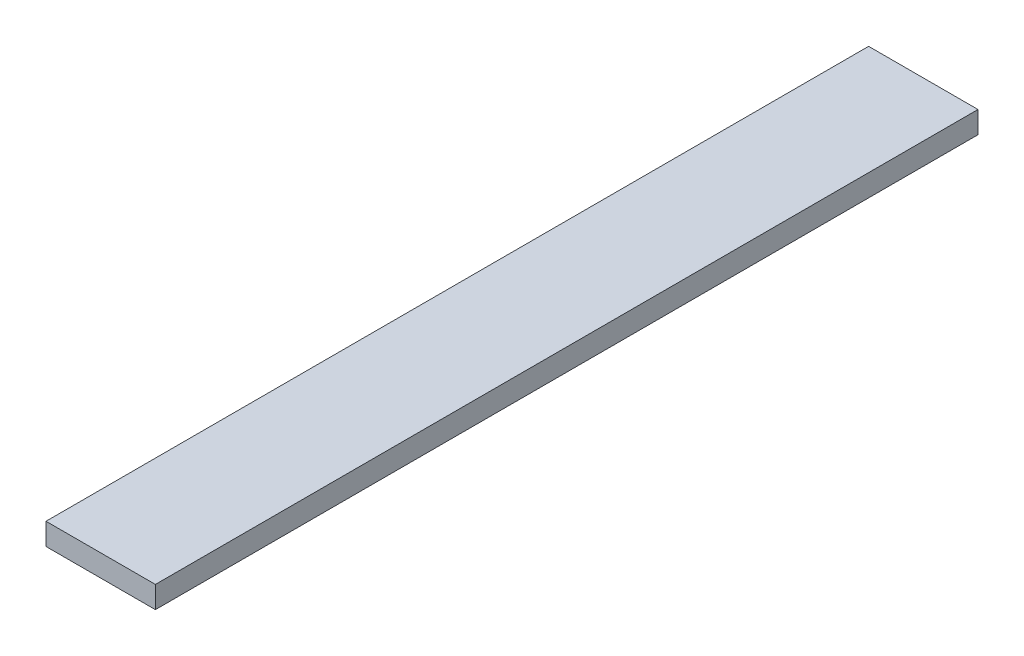
ISO-10303-21;
HEADER;
FILE_DESCRIPTION(('STEP AP214'),'2;1');
FILE_NAME('part.step','',(''),(''),'','','');
FILE_SCHEMA(('AUTOMOTIVE_DESIGN { 1 0 10303 214 1 1 1 1 }'));
ENDSEC;
DATA;
#1=APPLICATION_CONTEXT('core data for automotive mechanical design processes');
#2=APPLICATION_PROTOCOL_DEFINITION('international standard','automotive_design',2000,#1);
#3=PRODUCT_CONTEXT('',#1,'mechanical');
#4=PRODUCT('Part','Part','',(#3));
#5=PRODUCT_RELATED_PRODUCT_CATEGORY('part','',(#4));
#6=PRODUCT_DEFINITION_FORMATION('','',#4);
#7=PRODUCT_DEFINITION_CONTEXT('part definition',#1,'design');
#8=PRODUCT_DEFINITION('design','',#6,#7);
#9=PRODUCT_DEFINITION_SHAPE('','',#8);
#10=(LENGTH_UNIT() NAMED_UNIT(*) SI_UNIT(.MILLI.,.METRE.));
#11=(NAMED_UNIT(*) PLANE_ANGLE_UNIT() SI_UNIT($,.RADIAN.));
#12=(NAMED_UNIT(*) SI_UNIT($,.STERADIAN.) SOLID_ANGLE_UNIT());
#13=UNCERTAINTY_MEASURE_WITH_UNIT(LENGTH_MEASURE(1.E-05),#10,'distance_accuracy_value','');
#14=(GEOMETRIC_REPRESENTATION_CONTEXT(3) GLOBAL_UNCERTAINTY_ASSIGNED_CONTEXT((#13)) GLOBAL_UNIT_ASSIGNED_CONTEXT((#10,
#11,#12)) REPRESENTATION_CONTEXT('',''));
#15=CARTESIAN_POINT('',(0.,0.,0.));
#16=DIRECTION('',(0.,0.,1.));
#17=DIRECTION('',(1.,0.,0.));
#18=AXIS2_PLACEMENT_3D('',#15,#16,#17);
#19=CARTESIAN_POINT('',(0.,1.42999999999,0.));
#20=DIRECTION('',(0.,-1.,0.));
#21=DIRECTION('',(1.,0.,0.));
#22=AXIS2_PLACEMENT_3D('',#19,#20,#21);
#23=PLANE('',#22);
#24=DIRECTION('',(1.,0.,0.));
#25=VECTOR('',#24,1.);
#26=CARTESIAN_POINT('',(0.,1.42999999999,2.075));
#27=LINE('',#26,#25);
#28=CARTESIAN_POINT('',(-0.125,1.42999999999,2.075));
#29=VERTEX_POINT('',#28);
#30=CARTESIAN_POINT('',(-0.375,1.42999999999,2.075));
#31=VERTEX_POINT('',#30);
#32=EDGE_CURVE('E19',#29,#31,#27,.F.);
#33=ORIENTED_EDGE('',*,*,#32,.F.);
#34=DIRECTION('',(0.,0.,1.));
#35=VECTOR('',#34,1.);
#36=CARTESIAN_POINT('',(-0.125,1.42999999999,0.195));
#37=LINE('',#36,#35);
#38=CARTESIAN_POINT('',(-0.125,1.42999999999,0.195));
#39=VERTEX_POINT('',#38);
#40=EDGE_CURVE('E68',#29,#39,#37,.F.);
#41=ORIENTED_EDGE('',*,*,#40,.T.);
#42=DIRECTION('',(1.,0.,0.));
#43=VECTOR('',#42,1.);
#44=CARTESIAN_POINT('',(-0.375,1.42999999999,0.195));
#45=LINE('',#44,#43);
#46=CARTESIAN_POINT('',(-0.375,1.42999999999,0.195));
#47=VERTEX_POINT('',#46);
#48=EDGE_CURVE('E55',#39,#47,#45,.F.);
#49=ORIENTED_EDGE('',*,*,#48,.T.);
#50=DIRECTION('',(0.,0.,1.));
#51=VECTOR('',#50,1.);
#52=CARTESIAN_POINT('',(-0.375,1.42999999999,0.195));
#53=LINE('',#52,#51);
#54=EDGE_CURVE('E61',#47,#31,#53,.T.);
#55=ORIENTED_EDGE('',*,*,#54,.T.);
#56=EDGE_LOOP('',(#33,#41,#49,#55));
#57=FACE_BOUND('',#56,.T.);
#58=ADVANCED_FACE('F16',(#57),#23,.F.);
#59=CARTESIAN_POINT('',(-0.375,1.37999999999,0.195));
#60=DIRECTION('',(1.,0.,0.));
#61=DIRECTION('',(0.,1.,0.));
#62=AXIS2_PLACEMENT_3D('',#59,#60,#61);
#63=PLANE('',#62);
#64=DIRECTION('',(0.,1.,0.));
#65=VECTOR('',#64,1.);
#66=CARTESIAN_POINT('',(-0.375,1.37999999999,0.195));
#67=LINE('',#66,#65);
#68=CARTESIAN_POINT('',(-0.375,1.37999999999,0.195));
#69=VERTEX_POINT('',#68);
#70=EDGE_CURVE('E63',#47,#69,#67,.F.);
#71=ORIENTED_EDGE('',*,*,#70,.T.);
#72=DIRECTION('',(0.,0.,1.));
#73=VECTOR('',#72,1.);
#74=CARTESIAN_POINT('',(-0.375,1.37999999999,0.));
#75=LINE('',#74,#73);
#76=CARTESIAN_POINT('',(-0.375,1.37999999999,2.075));
#77=VERTEX_POINT('',#76);
#78=EDGE_CURVE('E82',#77,#69,#75,.F.);
#79=ORIENTED_EDGE('',*,*,#78,.F.);
#80=DIRECTION('',(0.,1.,0.));
#81=VECTOR('',#80,1.);
#82=CARTESIAN_POINT('',(-0.375,1.37999999999,2.075));
#83=LINE('',#82,#81);
#84=EDGE_CURVE('E66',#77,#31,#83,.T.);
#85=ORIENTED_EDGE('',*,*,#84,.T.);
#86=ORIENTED_EDGE('',*,*,#54,.F.);
#87=EDGE_LOOP('',(#71,#79,#85,#86));
#88=FACE_BOUND('',#87,.T.);
#89=ADVANCED_FACE('F62',(#88),#63,.F.);
#90=CARTESIAN_POINT('',(-0.375,1.37999999999,0.195));
#91=DIRECTION('',(0.,0.,1.));
#92=DIRECTION('',(1.,0.,0.));
#93=AXIS2_PLACEMENT_3D('',#90,#91,#92);
#94=PLANE('',#93);
#95=DIRECTION('',(0.,-1.,0.));
#96=VECTOR('',#95,1.);
#97=CARTESIAN_POINT('',(-0.125,1.37999999999,0.195));
#98=LINE('',#97,#96);
#99=CARTESIAN_POINT('',(-0.125,1.37999999999,0.195));
#100=VERTEX_POINT('',#99);
#101=EDGE_CURVE('E70',#39,#100,#98,.T.);
#102=ORIENTED_EDGE('',*,*,#101,.T.);
#103=DIRECTION('',(1.,0.,0.));
#104=VECTOR('',#103,1.);
#105=CARTESIAN_POINT('',(0.,1.37999999999,0.195));
#106=LINE('',#105,#104);
#107=EDGE_CURVE('E74',#69,#100,#106,.T.);
#108=ORIENTED_EDGE('',*,*,#107,.F.);
#109=ORIENTED_EDGE('',*,*,#70,.F.);
#110=ORIENTED_EDGE('',*,*,#48,.F.);
#111=EDGE_LOOP('',(#102,#108,#109,#110));
#112=FACE_BOUND('',#111,.T.);
#113=ADVANCED_FACE('F72',(#112),#94,.F.);
#114=CARTESIAN_POINT('',(-0.125,1.37999999999,0.195));
#115=DIRECTION('',(-1.,0.,0.));
#116=DIRECTION('',(0.,-1.,0.));
#117=AXIS2_PLACEMENT_3D('',#114,#115,#116);
#118=PLANE('',#117);
#119=DIRECTION('',(0.,1.,0.));
#120=VECTOR('',#119,1.);
#121=CARTESIAN_POINT('',(-0.125,1.37999999999,2.075));
#122=LINE('',#121,#120);
#123=CARTESIAN_POINT('',(-0.125,1.37999999999,2.075));
#124=VERTEX_POINT('',#123);
#125=EDGE_CURVE('E34',#29,#124,#122,.F.);
#126=ORIENTED_EDGE('',*,*,#125,.T.);
#127=DIRECTION('',(0.,0.,1.));
#128=VECTOR('',#127,1.);
#129=CARTESIAN_POINT('',(-0.125,1.37999999999,0.));
#130=LINE('',#129,#128);
#131=EDGE_CURVE('E25',#100,#124,#130,.T.);
#132=ORIENTED_EDGE('',*,*,#131,.F.);
#133=ORIENTED_EDGE('',*,*,#101,.F.);
#134=ORIENTED_EDGE('',*,*,#40,.F.);
#135=EDGE_LOOP('',(#126,#132,#133,#134));
#136=FACE_BOUND('',#135,.T.);
#137=ADVANCED_FACE('F88',(#136),#118,.F.);
#138=CARTESIAN_POINT('',(-0.375,1.37999999999,2.075));
#139=DIRECTION('',(0.,0.,-1.));
#140=DIRECTION('',(-1.,0.,0.));
#141=AXIS2_PLACEMENT_3D('',#138,#139,#140);
#142=PLANE('',#141);
#143=ORIENTED_EDGE('',*,*,#84,.F.);
#144=DIRECTION('',(1.,0.,0.));
#145=VECTOR('',#144,1.);
#146=CARTESIAN_POINT('',(0.,1.37999999999,2.075));
#147=LINE('',#146,#145);
#148=EDGE_CURVE('E11',#124,#77,#147,.F.);
#149=ORIENTED_EDGE('',*,*,#148,.F.);
#150=ORIENTED_EDGE('',*,*,#125,.F.);
#151=ORIENTED_EDGE('',*,*,#32,.T.);
#152=EDGE_LOOP('',(#143,#149,#150,#151));
#153=FACE_BOUND('',#152,.T.);
#154=ADVANCED_FACE('F90',(#153),#142,.F.);
#155=CARTESIAN_POINT('',(0.,1.37999999999,0.));
#156=DIRECTION('',(0.,-1.,0.));
#157=DIRECTION('',(1.,0.,0.));
#158=AXIS2_PLACEMENT_3D('',#155,#156,#157);
#159=PLANE('',#158);
#160=ORIENTED_EDGE('',*,*,#131,.T.);
#161=ORIENTED_EDGE('',*,*,#148,.T.);
#162=ORIENTED_EDGE('',*,*,#78,.T.);
#163=ORIENTED_EDGE('',*,*,#107,.T.);
#164=EDGE_LOOP('',(#160,#161,#162,#163));
#165=FACE_BOUND('',#164,.T.);
#166=ADVANCED_FACE('F87',(#165),#159,.T.);
#167=CLOSED_SHELL('',(#58,#89,#113,#137,#154,#166));
#168=MANIFOLD_SOLID_BREP('B1',#167);
#169=ADVANCED_BREP_SHAPE_REPRESENTATION('',(#18,#168),#14);
#170=SHAPE_DEFINITION_REPRESENTATION(#9,#169);
ENDSEC;
END-ISO-10303-21;
